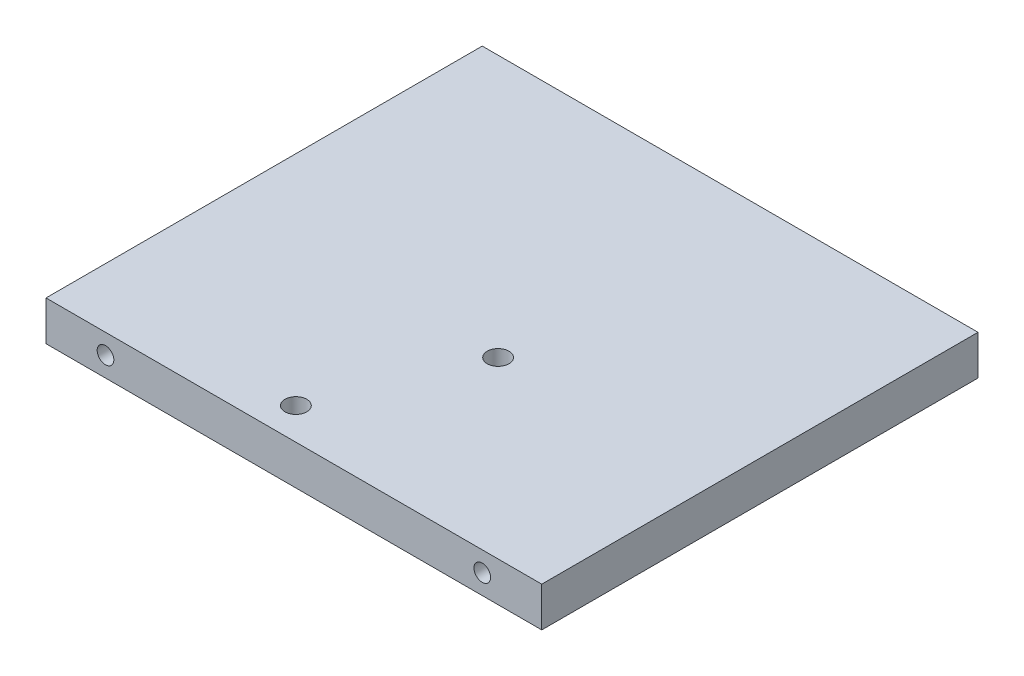
ISO-10303-21;
HEADER;
FILE_DESCRIPTION(('STEP AP214'),'2;1');
FILE_NAME('part.step','',(''),(''),'','','');
FILE_SCHEMA(('AUTOMOTIVE_DESIGN { 1 0 10303 214 1 1 1 1 }'));
ENDSEC;
DATA;
#1=APPLICATION_CONTEXT('core data for automotive mechanical design processes');
#2=APPLICATION_PROTOCOL_DEFINITION('international standard','automotive_design',2000,#1);
#3=PRODUCT_CONTEXT('',#1,'mechanical');
#4=PRODUCT('Part','Part','',(#3));
#5=PRODUCT_RELATED_PRODUCT_CATEGORY('part','',(#4));
#6=PRODUCT_DEFINITION_FORMATION('','',#4);
#7=PRODUCT_DEFINITION_CONTEXT('part definition',#1,'design');
#8=PRODUCT_DEFINITION('design','',#6,#7);
#9=PRODUCT_DEFINITION_SHAPE('','',#8);
#10=(LENGTH_UNIT() NAMED_UNIT(*) SI_UNIT(.MILLI.,.METRE.));
#11=(NAMED_UNIT(*) PLANE_ANGLE_UNIT() SI_UNIT($,.RADIAN.));
#12=(NAMED_UNIT(*) SI_UNIT($,.STERADIAN.) SOLID_ANGLE_UNIT());
#13=UNCERTAINTY_MEASURE_WITH_UNIT(LENGTH_MEASURE(1.E-05),#10,'distance_accuracy_value','');
#14=(GEOMETRIC_REPRESENTATION_CONTEXT(3) GLOBAL_UNCERTAINTY_ASSIGNED_CONTEXT((#13)) GLOBAL_UNIT_ASSIGNED_CONTEXT((#10,
#11,#12)) REPRESENTATION_CONTEXT('',''));
#15=CARTESIAN_POINT('',(0.,0.,0.));
#16=DIRECTION('',(0.,0.,1.));
#17=DIRECTION('',(1.,0.,0.));
#18=AXIS2_PLACEMENT_3D('',#15,#16,#17);
#19=CARTESIAN_POINT('',(7.5,10.,11.));
#20=DIRECTION('',(0.,-1.,0.));
#21=DIRECTION('',(0.,0.,-1.));
#22=AXIS2_PLACEMENT_3D('',#19,#20,#21);
#23=CYLINDRICAL_SURFACE('',#22,2.75);
#24=CARTESIAN_POINT('',(7.5,10.,11.));
#25=DIRECTION('',(0.,1.,0.));
#26=DIRECTION('',(0.,0.,1.));
#27=AXIS2_PLACEMENT_3D('',#24,#25,#26);
#28=CIRCLE('',#27,2.75);
#29=CARTESIAN_POINT('',(7.5,10.,13.75));
#30=VERTEX_POINT('',#29);
#31=EDGE_CURVE('E155',#30,#30,#28,.T.);
#32=ORIENTED_EDGE('',*,*,#31,.T.);
#33=EDGE_LOOP('',(#32));
#34=FACE_BOUND('',#33,.T.);
#35=CARTESIAN_POINT('',(7.5,5.7,11.));
#36=DIRECTION('',(0.,-1.,0.));
#37=DIRECTION('',(0.,0.,-1.));
#38=AXIS2_PLACEMENT_3D('',#35,#36,#37);
#39=CIRCLE('',#38,2.75);
#40=CARTESIAN_POINT('',(7.5,5.7,8.25000000000001));
#41=VERTEX_POINT('',#40);
#42=EDGE_CURVE('E49',#41,#41,#39,.T.);
#43=ORIENTED_EDGE('',*,*,#42,.T.);
#44=EDGE_LOOP('',(#43));
#45=FACE_BOUND('',#44,.T.);
#46=ADVANCED_FACE('F45',(#34,#45),#23,.F.);
#47=CARTESIAN_POINT('',(-7.49999999999999,10.,47.));
#48=DIRECTION('',(0.,-1.,0.));
#49=DIRECTION('',(0.,0.,-1.));
#50=AXIS2_PLACEMENT_3D('',#47,#48,#49);
#51=CYLINDRICAL_SURFACE('',#50,2.75);
#52=CARTESIAN_POINT('',(-7.49999999999999,10.,47.));
#53=DIRECTION('',(0.,1.,0.));
#54=DIRECTION('',(0.,0.,1.));
#55=AXIS2_PLACEMENT_3D('',#52,#53,#54);
#56=CIRCLE('',#55,2.75);
#57=CARTESIAN_POINT('',(-7.49999999999999,10.,49.75));
#58=VERTEX_POINT('',#57);
#59=EDGE_CURVE('E151',#58,#58,#56,.T.);
#60=ORIENTED_EDGE('',*,*,#59,.T.);
#61=EDGE_LOOP('',(#60));
#62=FACE_BOUND('',#61,.T.);
#63=CARTESIAN_POINT('',(-7.49999999999999,5.7,47.));
#64=DIRECTION('',(0.,-1.,0.));
#65=DIRECTION('',(0.,0.,-1.));
#66=AXIS2_PLACEMENT_3D('',#63,#64,#65);
#67=CIRCLE('',#66,2.75);
#68=CARTESIAN_POINT('',(-7.49999999999999,5.7,44.25));
#69=VERTEX_POINT('',#68);
#70=EDGE_CURVE('E187',#69,#69,#67,.T.);
#71=ORIENTED_EDGE('',*,*,#70,.T.);
#72=EDGE_LOOP('',(#71));
#73=FACE_BOUND('',#72,.T.);
#74=ADVANCED_FACE('F240',(#62,#73),#51,.F.);
#75=CARTESIAN_POINT('',(0.,10.,0.));
#76=DIRECTION('',(0.,-1.,0.));
#77=DIRECTION('',(0.,0.,-1.));
#78=AXIS2_PLACEMENT_3D('',#75,#76,#77);
#79=PLANE('',#78);
#80=DIRECTION('',(0.,0.,-1.));
#81=VECTOR('',#80,1.);
#82=CARTESIAN_POINT('',(62.5,10.,55.));
#83=LINE('',#82,#81);
#84=CARTESIAN_POINT('',(62.5,10.,55.));
#85=VERTEX_POINT('',#84);
#86=CARTESIAN_POINT('',(62.5,10.,-55.));
#87=VERTEX_POINT('',#86);
#88=EDGE_CURVE('E160',#85,#87,#83,.T.);
#89=ORIENTED_EDGE('',*,*,#88,.T.);
#90=DIRECTION('',(-1.,0.,0.));
#91=VECTOR('',#90,1.);
#92=CARTESIAN_POINT('',(-62.5,10.,-55.));
#93=LINE('',#92,#91);
#94=CARTESIAN_POINT('',(-62.5,10.,-55.));
#95=VERTEX_POINT('',#94);
#96=EDGE_CURVE('E96',#87,#95,#93,.T.);
#97=ORIENTED_EDGE('',*,*,#96,.T.);
#98=DIRECTION('',(0.,0.,1.));
#99=VECTOR('',#98,1.);
#100=CARTESIAN_POINT('',(-62.5,10.,55.));
#101=LINE('',#100,#99);
#102=CARTESIAN_POINT('',(-62.5,10.,55.));
#103=VERTEX_POINT('',#102);
#104=EDGE_CURVE('E165',#95,#103,#101,.T.);
#105=ORIENTED_EDGE('',*,*,#104,.T.);
#106=DIRECTION('',(1.,0.,0.));
#107=VECTOR('',#106,1.);
#108=CARTESIAN_POINT('',(-62.5,10.,55.));
#109=LINE('',#108,#107);
#110=EDGE_CURVE('E65',#103,#85,#109,.T.);
#111=ORIENTED_EDGE('',*,*,#110,.T.);
#112=EDGE_LOOP('',(#89,#97,#105,#111));
#113=FACE_BOUND('',#112,.T.);
#114=ORIENTED_EDGE('',*,*,#31,.F.);
#115=EDGE_LOOP('',(#114));
#116=FACE_BOUND('',#115,.T.);
#117=ORIENTED_EDGE('',*,*,#59,.F.);
#118=EDGE_LOOP('',(#117));
#119=FACE_BOUND('',#118,.T.);
#120=ADVANCED_FACE('F218',(#113,#116,#119),#79,.F.);
#121=CARTESIAN_POINT('',(0.,0.,0.));
#122=DIRECTION('',(0.,-1.,0.));
#123=DIRECTION('',(0.,0.,-1.));
#124=AXIS2_PLACEMENT_3D('',#121,#122,#123);
#125=PLANE('',#124);
#126=CARTESIAN_POINT('',(7.5,0.,11.));
#127=DIRECTION('',(0.,-1.,0.));
#128=DIRECTION('',(0.,0.,-1.));
#129=AXIS2_PLACEMENT_3D('',#126,#127,#128);
#130=CIRCLE('',#129,5.);
#131=CARTESIAN_POINT('',(7.5,0.,6.00000000000001));
#132=VERTEX_POINT('',#131);
#133=EDGE_CURVE('E197',#132,#132,#130,.T.);
#134=ORIENTED_EDGE('',*,*,#133,.F.);
#135=EDGE_LOOP('',(#134));
#136=FACE_BOUND('',#135,.T.);
#137=CARTESIAN_POINT('',(-7.49999999999999,0.,47.));
#138=DIRECTION('',(0.,-1.,0.));
#139=DIRECTION('',(0.,0.,-1.));
#140=AXIS2_PLACEMENT_3D('',#137,#138,#139);
#141=CIRCLE('',#140,5.);
#142=CARTESIAN_POINT('',(-7.49999999999999,0.,42.));
#143=VERTEX_POINT('',#142);
#144=EDGE_CURVE('E208',#143,#143,#141,.T.);
#145=ORIENTED_EDGE('',*,*,#144,.F.);
#146=EDGE_LOOP('',(#145));
#147=FACE_BOUND('',#146,.T.);
#148=DIRECTION('',(0.,0.,-1.));
#149=VECTOR('',#148,1.);
#150=CARTESIAN_POINT('',(62.5,0.,55.));
#151=LINE('',#150,#149);
#152=CARTESIAN_POINT('',(62.5,0.,55.));
#153=VERTEX_POINT('',#152);
#154=CARTESIAN_POINT('',(62.5,0.,-55.));
#155=VERTEX_POINT('',#154);
#156=EDGE_CURVE('E159',#153,#155,#151,.T.);
#157=ORIENTED_EDGE('',*,*,#156,.F.);
#158=DIRECTION('',(1.,0.,0.));
#159=VECTOR('',#158,1.);
#160=CARTESIAN_POINT('',(-62.5,0.,55.));
#161=LINE('',#160,#159);
#162=CARTESIAN_POINT('',(-62.5,0.,55.));
#163=VERTEX_POINT('',#162);
#164=EDGE_CURVE('E89',#163,#153,#161,.T.);
#165=ORIENTED_EDGE('',*,*,#164,.F.);
#166=DIRECTION('',(0.,0.,1.));
#167=VECTOR('',#166,1.);
#168=CARTESIAN_POINT('',(-62.5,0.,55.));
#169=LINE('',#168,#167);
#170=CARTESIAN_POINT('',(-62.5,0.,-55.));
#171=VERTEX_POINT('',#170);
#172=EDGE_CURVE('E83',#171,#163,#169,.T.);
#173=ORIENTED_EDGE('',*,*,#172,.F.);
#174=DIRECTION('',(-1.,0.,0.));
#175=VECTOR('',#174,1.);
#176=CARTESIAN_POINT('',(-62.5,0.,-55.));
#177=LINE('',#176,#175);
#178=EDGE_CURVE('E174',#155,#171,#177,.T.);
#179=ORIENTED_EDGE('',*,*,#178,.F.);
#180=EDGE_LOOP('',(#157,#165,#173,#179));
#181=FACE_BOUND('',#180,.T.);
#182=ADVANCED_FACE('F215',(#136,#147,#181),#125,.T.);
#183=CARTESIAN_POINT('',(62.5,10.,55.));
#184=DIRECTION('',(-1.,0.,0.));
#185=DIRECTION('',(0.,0.,1.));
#186=AXIS2_PLACEMENT_3D('',#183,#184,#185);
#187=PLANE('',#186);
#188=ORIENTED_EDGE('',*,*,#156,.T.);
#189=DIRECTION('',(0.,-1.,0.));
#190=VECTOR('',#189,1.);
#191=CARTESIAN_POINT('',(62.5,10.,-55.));
#192=LINE('',#191,#190);
#193=EDGE_CURVE('E11',#87,#155,#192,.T.);
#194=ORIENTED_EDGE('',*,*,#193,.F.);
#195=ORIENTED_EDGE('',*,*,#88,.F.);
#196=DIRECTION('',(0.,-1.,0.));
#197=VECTOR('',#196,1.);
#198=CARTESIAN_POINT('',(62.5,10.,55.));
#199=LINE('',#198,#197);
#200=EDGE_CURVE('E170',#85,#153,#199,.T.);
#201=ORIENTED_EDGE('',*,*,#200,.T.);
#202=EDGE_LOOP('',(#188,#194,#195,#201));
#203=FACE_BOUND('',#202,.T.);
#204=ADVANCED_FACE('F47',(#203),#187,.F.);
#205=CARTESIAN_POINT('',(-62.5,10.,-55.));
#206=DIRECTION('',(0.,0.,1.));
#207=DIRECTION('',(1.,0.,0.));
#208=AXIS2_PLACEMENT_3D('',#205,#206,#207);
#209=PLANE('',#208);
#210=CARTESIAN_POINT('',(47.5,5.,-55.));
#211=DIRECTION('',(0.,0.,-1.));
#212=DIRECTION('',(-1.,0.,0.));
#213=AXIS2_PLACEMENT_3D('',#210,#211,#212);
#214=CIRCLE('',#213,2.09999999999999);
#215=CARTESIAN_POINT('',(45.4,5.,-55.));
#216=VERTEX_POINT('',#215);
#217=EDGE_CURVE('E135',#216,#216,#214,.T.);
#218=ORIENTED_EDGE('',*,*,#217,.F.);
#219=EDGE_LOOP('',(#218));
#220=FACE_BOUND('',#219,.T.);
#221=CARTESIAN_POINT('',(-47.5,5.,-55.));
#222=DIRECTION('',(0.,0.,-1.));
#223=DIRECTION('',(-1.,0.,0.));
#224=AXIS2_PLACEMENT_3D('',#221,#222,#223);
#225=CIRCLE('',#224,2.09999999999999);
#226=CARTESIAN_POINT('',(-49.6,5.,-55.));
#227=VERTEX_POINT('',#226);
#228=EDGE_CURVE('E143',#227,#227,#225,.T.);
#229=ORIENTED_EDGE('',*,*,#228,.F.);
#230=EDGE_LOOP('',(#229));
#231=FACE_BOUND('',#230,.T.);
#232=ORIENTED_EDGE('',*,*,#178,.T.);
#233=DIRECTION('',(0.,-1.,0.));
#234=VECTOR('',#233,1.);
#235=CARTESIAN_POINT('',(-62.5,10.,-55.));
#236=LINE('',#235,#234);
#237=EDGE_CURVE('E56',#95,#171,#236,.T.);
#238=ORIENTED_EDGE('',*,*,#237,.F.);
#239=ORIENTED_EDGE('',*,*,#96,.F.);
#240=ORIENTED_EDGE('',*,*,#193,.T.);
#241=EDGE_LOOP('',(#232,#238,#239,#240));
#242=FACE_BOUND('',#241,.T.);
#243=ADVANCED_FACE('F229',(#220,#231,#242),#209,.F.);
#244=CARTESIAN_POINT('',(-62.5,10.,55.));
#245=DIRECTION('',(1.,0.,0.));
#246=DIRECTION('',(0.,0.,-1.));
#247=AXIS2_PLACEMENT_3D('',#244,#245,#246);
#248=PLANE('',#247);
#249=ORIENTED_EDGE('',*,*,#172,.T.);
#250=DIRECTION('',(0.,-1.,0.));
#251=VECTOR('',#250,1.);
#252=CARTESIAN_POINT('',(-62.5,10.,55.));
#253=LINE('',#252,#251);
#254=EDGE_CURVE('E183',#103,#163,#253,.T.);
#255=ORIENTED_EDGE('',*,*,#254,.F.);
#256=ORIENTED_EDGE('',*,*,#104,.F.);
#257=ORIENTED_EDGE('',*,*,#237,.T.);
#258=EDGE_LOOP('',(#249,#255,#256,#257));
#259=FACE_BOUND('',#258,.T.);
#260=ADVANCED_FACE('F227',(#259),#248,.F.);
#261=CARTESIAN_POINT('',(-62.5,10.,55.));
#262=DIRECTION('',(0.,0.,-1.));
#263=DIRECTION('',(-1.,0.,0.));
#264=AXIS2_PLACEMENT_3D('',#261,#262,#263);
#265=PLANE('',#264);
#266=CARTESIAN_POINT('',(-47.5,5.,55.));
#267=DIRECTION('',(0.,0.,1.));
#268=DIRECTION('',(1.,0.,0.));
#269=AXIS2_PLACEMENT_3D('',#266,#267,#268);
#270=CIRCLE('',#269,2.09999999999999);
#271=CARTESIAN_POINT('',(-45.4,5.,55.));
#272=VERTEX_POINT('',#271);
#273=EDGE_CURVE('E121',#272,#272,#270,.T.);
#274=ORIENTED_EDGE('',*,*,#273,.F.);
#275=EDGE_LOOP('',(#274));
#276=FACE_BOUND('',#275,.T.);
#277=CARTESIAN_POINT('',(47.5,5.,55.));
#278=DIRECTION('',(0.,0.,1.));
#279=DIRECTION('',(1.,0.,0.));
#280=AXIS2_PLACEMENT_3D('',#277,#278,#279);
#281=CIRCLE('',#280,2.09999999999999);
#282=CARTESIAN_POINT('',(49.6,5.,55.));
#283=VERTEX_POINT('',#282);
#284=EDGE_CURVE('E120',#283,#283,#281,.T.);
#285=ORIENTED_EDGE('',*,*,#284,.F.);
#286=EDGE_LOOP('',(#285));
#287=FACE_BOUND('',#286,.T.);
#288=ORIENTED_EDGE('',*,*,#164,.T.);
#289=ORIENTED_EDGE('',*,*,#200,.F.);
#290=ORIENTED_EDGE('',*,*,#110,.F.);
#291=ORIENTED_EDGE('',*,*,#254,.T.);
#292=EDGE_LOOP('',(#288,#289,#290,#291));
#293=FACE_BOUND('',#292,.T.);
#294=ADVANCED_FACE('F225',(#276,#287,#293),#265,.F.);
#295=CARTESIAN_POINT('',(-47.5,5.,-39.));
#296=DIRECTION('',(0.,0.,-1.));
#297=DIRECTION('',(-1.,0.,0.));
#298=AXIS2_PLACEMENT_3D('',#295,#296,#297);
#299=CONICAL_SURFACE('',#298,2.09999999999999,1.02974425867666);
#300=CARTESIAN_POINT('',(-47.5,5.,-37.7381927000421));
#301=VERTEX_POINT('',#300);
#302=VERTEX_LOOP('',#301);
#303=FACE_BOUND('',#302,.T.);
#304=CARTESIAN_POINT('',(-47.5,5.,-39.));
#305=DIRECTION('',(0.,0.,-1.));
#306=DIRECTION('',(-1.,0.,0.));
#307=AXIS2_PLACEMENT_3D('',#304,#305,#306);
#308=CIRCLE('',#307,2.09999999999999);
#309=CARTESIAN_POINT('',(-49.6,5.,-39.));
#310=VERTEX_POINT('',#309);
#311=EDGE_CURVE('E147',#310,#310,#308,.T.);
#312=ORIENTED_EDGE('',*,*,#311,.T.);
#313=EDGE_LOOP('',(#312));
#314=FACE_BOUND('',#313,.T.);
#315=ADVANCED_FACE('F254',(#303,#314),#299,.F.);
#316=CARTESIAN_POINT('',(-47.5,5.,-55.));
#317=DIRECTION('',(0.,0.,-1.));
#318=DIRECTION('',(-1.,0.,0.));
#319=AXIS2_PLACEMENT_3D('',#316,#317,#318);
#320=CYLINDRICAL_SURFACE('',#319,2.09999999999999);
#321=ORIENTED_EDGE('',*,*,#311,.F.);
#322=EDGE_LOOP('',(#321));
#323=FACE_BOUND('',#322,.T.);
#324=ORIENTED_EDGE('',*,*,#228,.T.);
#325=EDGE_LOOP('',(#324));
#326=FACE_BOUND('',#325,.T.);
#327=ADVANCED_FACE('F259',(#323,#326),#320,.F.);
#328=CARTESIAN_POINT('',(47.5,5.,-39.));
#329=DIRECTION('',(0.,0.,-1.));
#330=DIRECTION('',(-1.,0.,0.));
#331=AXIS2_PLACEMENT_3D('',#328,#329,#330);
#332=CONICAL_SURFACE('',#331,2.09999999999999,1.02974425867666);
#333=CARTESIAN_POINT('',(47.5,5.,-37.7381927000421));
#334=VERTEX_POINT('',#333);
#335=VERTEX_LOOP('',#334);
#336=FACE_BOUND('',#335,.T.);
#337=CARTESIAN_POINT('',(47.5,5.,-39.));
#338=DIRECTION('',(0.,0.,-1.));
#339=DIRECTION('',(-1.,0.,0.));
#340=AXIS2_PLACEMENT_3D('',#337,#338,#339);
#341=CIRCLE('',#340,2.09999999999999);
#342=CARTESIAN_POINT('',(45.4,5.,-39.));
#343=VERTEX_POINT('',#342);
#344=EDGE_CURVE('E139',#343,#343,#341,.T.);
#345=ORIENTED_EDGE('',*,*,#344,.T.);
#346=EDGE_LOOP('',(#345));
#347=FACE_BOUND('',#346,.T.);
#348=ADVANCED_FACE('F280',(#336,#347),#332,.F.);
#349=CARTESIAN_POINT('',(47.5,5.,-55.));
#350=DIRECTION('',(0.,0.,-1.));
#351=DIRECTION('',(-1.,0.,0.));
#352=AXIS2_PLACEMENT_3D('',#349,#350,#351);
#353=CYLINDRICAL_SURFACE('',#352,2.09999999999999);
#354=ORIENTED_EDGE('',*,*,#344,.F.);
#355=EDGE_LOOP('',(#354));
#356=FACE_BOUND('',#355,.T.);
#357=ORIENTED_EDGE('',*,*,#217,.T.);
#358=EDGE_LOOP('',(#357));
#359=FACE_BOUND('',#358,.T.);
#360=ADVANCED_FACE('F272',(#356,#359),#353,.F.);
#361=CARTESIAN_POINT('',(47.5,5.,39.));
#362=DIRECTION('',(0.,0.,1.));
#363=DIRECTION('',(1.,0.,0.));
#364=AXIS2_PLACEMENT_3D('',#361,#362,#363);
#365=CONICAL_SURFACE('',#364,2.09999999999999,1.02974425867666);
#366=CARTESIAN_POINT('',(47.5,5.,37.7381927000421));
#367=VERTEX_POINT('',#366);
#368=VERTEX_LOOP('',#367);
#369=FACE_BOUND('',#368,.T.);
#370=CARTESIAN_POINT('',(47.5,5.,39.));
#371=DIRECTION('',(0.,0.,1.));
#372=DIRECTION('',(1.,0.,0.));
#373=AXIS2_PLACEMENT_3D('',#370,#371,#372);
#374=CIRCLE('',#373,2.09999999999999);
#375=CARTESIAN_POINT('',(49.6,5.,39.));
#376=VERTEX_POINT('',#375);
#377=EDGE_CURVE('E126',#376,#376,#374,.T.);
#378=ORIENTED_EDGE('',*,*,#377,.T.);
#379=EDGE_LOOP('',(#378));
#380=FACE_BOUND('',#379,.T.);
#381=ADVANCED_FACE('F266',(#369,#380),#365,.F.);
#382=CARTESIAN_POINT('',(47.5,5.,55.));
#383=DIRECTION('',(0.,0.,1.));
#384=DIRECTION('',(1.,0.,0.));
#385=AXIS2_PLACEMENT_3D('',#382,#383,#384);
#386=CYLINDRICAL_SURFACE('',#385,2.09999999999999);
#387=ORIENTED_EDGE('',*,*,#377,.F.);
#388=EDGE_LOOP('',(#387));
#389=FACE_BOUND('',#388,.T.);
#390=ORIENTED_EDGE('',*,*,#284,.T.);
#391=EDGE_LOOP('',(#390));
#392=FACE_BOUND('',#391,.T.);
#393=ADVANCED_FACE('F113',(#389,#392),#386,.F.);
#394=CARTESIAN_POINT('',(-47.5,5.,39.));
#395=DIRECTION('',(0.,0.,1.));
#396=DIRECTION('',(1.,0.,0.));
#397=AXIS2_PLACEMENT_3D('',#394,#395,#396);
#398=CONICAL_SURFACE('',#397,2.09999999999999,1.02974425867666);
#399=CARTESIAN_POINT('',(-47.5,5.,37.7381927000421));
#400=VERTEX_POINT('',#399);
#401=VERTEX_LOOP('',#400);
#402=FACE_BOUND('',#401,.T.);
#403=CARTESIAN_POINT('',(-47.5,5.,39.));
#404=DIRECTION('',(0.,0.,1.));
#405=DIRECTION('',(1.,0.,0.));
#406=AXIS2_PLACEMENT_3D('',#403,#404,#405);
#407=CIRCLE('',#406,2.09999999999999);
#408=CARTESIAN_POINT('',(-45.4,5.,39.));
#409=VERTEX_POINT('',#408);
#410=EDGE_CURVE('E117',#409,#409,#407,.T.);
#411=ORIENTED_EDGE('',*,*,#410,.T.);
#412=EDGE_LOOP('',(#411));
#413=FACE_BOUND('',#412,.T.);
#414=ADVANCED_FACE('F109',(#402,#413),#398,.F.);
#415=CARTESIAN_POINT('',(-47.5,5.,55.));
#416=DIRECTION('',(0.,0.,1.));
#417=DIRECTION('',(1.,0.,0.));
#418=AXIS2_PLACEMENT_3D('',#415,#416,#417);
#419=CYLINDRICAL_SURFACE('',#418,2.09999999999999);
#420=ORIENTED_EDGE('',*,*,#410,.F.);
#421=EDGE_LOOP('',(#420));
#422=FACE_BOUND('',#421,.T.);
#423=ORIENTED_EDGE('',*,*,#273,.T.);
#424=EDGE_LOOP('',(#423));
#425=FACE_BOUND('',#424,.T.);
#426=ADVANCED_FACE('F112',(#422,#425),#419,.F.);
#427=CARTESIAN_POINT('',(-7.49999999999999,5.7,47.));
#428=DIRECTION('',(0.,-1.,0.));
#429=DIRECTION('',(0.,0.,-1.));
#430=AXIS2_PLACEMENT_3D('',#427,#428,#429);
#431=CYLINDRICAL_SURFACE('',#430,5.);
#432=CARTESIAN_POINT('',(-7.49999999999999,5.7,47.));
#433=DIRECTION('',(0.,-1.,0.));
#434=DIRECTION('',(0.,0.,-1.));
#435=AXIS2_PLACEMENT_3D('',#432,#433,#434);
#436=CIRCLE('',#435,5.);
#437=CARTESIAN_POINT('',(-7.49999999999999,5.7,42.));
#438=VERTEX_POINT('',#437);
#439=EDGE_CURVE('E203',#438,#438,#436,.T.);
#440=ORIENTED_EDGE('',*,*,#439,.F.);
#441=EDGE_LOOP('',(#440));
#442=FACE_BOUND('',#441,.T.);
#443=ORIENTED_EDGE('',*,*,#144,.T.);
#444=EDGE_LOOP('',(#443));
#445=FACE_BOUND('',#444,.T.);
#446=ADVANCED_FACE('F213',(#442,#445),#431,.F.);
#447=CARTESIAN_POINT('',(-7.49999999999999,5.7,47.));
#448=DIRECTION('',(0.,-1.,0.));
#449=DIRECTION('',(0.,0.,-1.));
#450=AXIS2_PLACEMENT_3D('',#447,#448,#449);
#451=PLANE('',#450);
#452=ORIENTED_EDGE('',*,*,#70,.F.);
#453=EDGE_LOOP('',(#452));
#454=FACE_BOUND('',#453,.T.);
#455=ORIENTED_EDGE('',*,*,#439,.T.);
#456=EDGE_LOOP('',(#455));
#457=FACE_BOUND('',#456,.T.);
#458=ADVANCED_FACE('F366',(#454,#457),#451,.T.);
#459=CARTESIAN_POINT('',(7.5,5.7,11.));
#460=DIRECTION('',(0.,-1.,0.));
#461=DIRECTION('',(0.,0.,-1.));
#462=AXIS2_PLACEMENT_3D('',#459,#460,#461);
#463=CYLINDRICAL_SURFACE('',#462,5.);
#464=CARTESIAN_POINT('',(7.5,5.7,11.));
#465=DIRECTION('',(0.,-1.,0.));
#466=DIRECTION('',(0.,0.,-1.));
#467=AXIS2_PLACEMENT_3D('',#464,#465,#466);
#468=CIRCLE('',#467,5.);
#469=CARTESIAN_POINT('',(7.5,5.7,6.00000000000001));
#470=VERTEX_POINT('',#469);
#471=EDGE_CURVE('E190',#470,#470,#468,.T.);
#472=ORIENTED_EDGE('',*,*,#471,.F.);
#473=EDGE_LOOP('',(#472));
#474=FACE_BOUND('',#473,.T.);
#475=ORIENTED_EDGE('',*,*,#133,.T.);
#476=EDGE_LOOP('',(#475));
#477=FACE_BOUND('',#476,.T.);
#478=ADVANCED_FACE('F376',(#474,#477),#463,.F.);
#479=CARTESIAN_POINT('',(7.5,5.7,11.));
#480=DIRECTION('',(0.,-1.,0.));
#481=DIRECTION('',(0.,0.,-1.));
#482=AXIS2_PLACEMENT_3D('',#479,#480,#481);
#483=PLANE('',#482);
#484=ORIENTED_EDGE('',*,*,#42,.F.);
#485=EDGE_LOOP('',(#484));
#486=FACE_BOUND('',#485,.T.);
#487=ORIENTED_EDGE('',*,*,#471,.T.);
#488=EDGE_LOOP('',(#487));
#489=FACE_BOUND('',#488,.T.);
#490=ADVANCED_FACE('F386',(#486,#489),#483,.T.);
#491=CLOSED_SHELL('',(#46,#74,#120,#182,#204,#243,#260,#294,#315,#327,#348,#360,#381,#393,#414,
#426,#446,#458,#478,#490));
#492=MANIFOLD_SOLID_BREP('B2',#491);
#493=ADVANCED_BREP_SHAPE_REPRESENTATION('',(#18,#492),#14);
#494=SHAPE_DEFINITION_REPRESENTATION(#9,#493);
ENDSEC;
END-ISO-10303-21;
